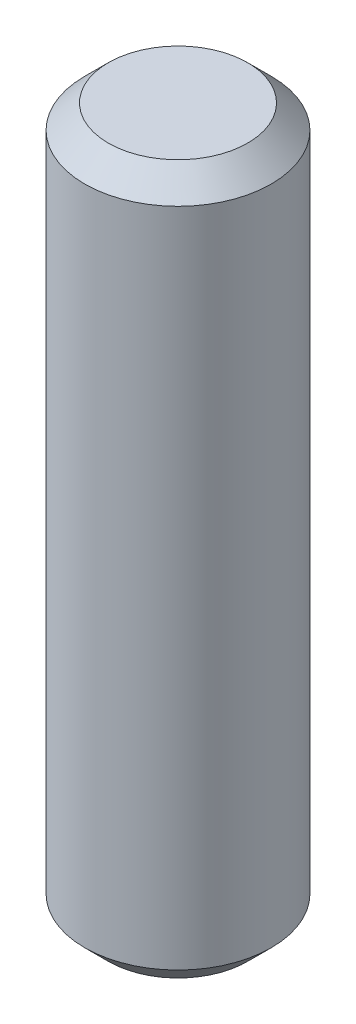
ISO-10303-21;
HEADER;
FILE_DESCRIPTION(('STEP AP214'),'2;1');
FILE_NAME('part.step','',(''),(''),'','','');
FILE_SCHEMA(('AUTOMOTIVE_DESIGN { 1 0 10303 214 1 1 1 1 }'));
ENDSEC;
DATA;
#1=APPLICATION_CONTEXT('core data for automotive mechanical design processes');
#2=APPLICATION_PROTOCOL_DEFINITION('international standard','automotive_design',2000,#1);
#3=PRODUCT_CONTEXT('',#1,'mechanical');
#4=PRODUCT('Part','Part','',(#3));
#5=PRODUCT_RELATED_PRODUCT_CATEGORY('part','',(#4));
#6=PRODUCT_DEFINITION_FORMATION('','',#4);
#7=PRODUCT_DEFINITION_CONTEXT('part definition',#1,'design');
#8=PRODUCT_DEFINITION('design','',#6,#7);
#9=PRODUCT_DEFINITION_SHAPE('','',#8);
#10=(LENGTH_UNIT() NAMED_UNIT(*) SI_UNIT(.MILLI.,.METRE.));
#11=(NAMED_UNIT(*) PLANE_ANGLE_UNIT() SI_UNIT($,.RADIAN.));
#12=(NAMED_UNIT(*) SI_UNIT($,.STERADIAN.) SOLID_ANGLE_UNIT());
#13=UNCERTAINTY_MEASURE_WITH_UNIT(LENGTH_MEASURE(1.E-05),#10,'distance_accuracy_value','');
#14=(GEOMETRIC_REPRESENTATION_CONTEXT(3) GLOBAL_UNCERTAINTY_ASSIGNED_CONTEXT((#13)) GLOBAL_UNIT_ASSIGNED_CONTEXT((#10,
#11,#12)) REPRESENTATION_CONTEXT('',''));
#15=CARTESIAN_POINT('',(0.,0.,0.));
#16=DIRECTION('',(0.,0.,1.));
#17=DIRECTION('',(1.,0.,0.));
#18=AXIS2_PLACEMENT_3D('',#15,#16,#17);
#19=CARTESIAN_POINT('',(0.,15.,0.));
#20=DIRECTION('',(0.,-1.,0.));
#21=DIRECTION('',(0.,0.,-1.));
#22=AXIS2_PLACEMENT_3D('',#19,#20,#21);
#23=CYLINDRICAL_SURFACE('',#22,3.95);
#24=CARTESIAN_POINT('',(0.,-14.,0.));
#25=DIRECTION('',(0.,1.,0.));
#26=DIRECTION('',(0.,0.,1.));
#27=AXIS2_PLACEMENT_3D('',#24,#25,#26);
#28=CIRCLE('',#27,3.95);
#29=CARTESIAN_POINT('',(0.,-14.,3.95));
#30=VERTEX_POINT('',#29);
#31=EDGE_CURVE('E47',#30,#30,#28,.T.);
#32=ORIENTED_EDGE('',*,*,#31,.T.);
#33=EDGE_LOOP('',(#32));
#34=FACE_BOUND('',#33,.T.);
#35=CARTESIAN_POINT('',(0.,14.,0.));
#36=DIRECTION('',(0.,1.,0.));
#37=DIRECTION('',(0.,0.,1.));
#38=AXIS2_PLACEMENT_3D('',#35,#36,#37);
#39=CIRCLE('',#38,3.95);
#40=CARTESIAN_POINT('',(0.,14.,3.95));
#41=VERTEX_POINT('',#40);
#42=EDGE_CURVE('E51',#41,#41,#39,.F.);
#43=ORIENTED_EDGE('',*,*,#42,.T.);
#44=EDGE_LOOP('',(#43));
#45=FACE_BOUND('',#44,.T.);
#46=ADVANCED_FACE('F35',(#34,#45),#23,.T.);
#47=CARTESIAN_POINT('',(0.,15.,0.));
#48=DIRECTION('',(0.,1.,0.));
#49=DIRECTION('',(0.,0.,1.));
#50=AXIS2_PLACEMENT_3D('',#47,#48,#49);
#51=PLANE('',#50);
#52=CARTESIAN_POINT('',(0.,15.,0.));
#53=DIRECTION('',(0.,1.,0.));
#54=DIRECTION('',(0.,0.,1.));
#55=AXIS2_PLACEMENT_3D('',#52,#53,#54);
#56=CIRCLE('',#55,2.94999999999999);
#57=CARTESIAN_POINT('',(0.,15.,2.94999999999999));
#58=VERTEX_POINT('',#57);
#59=EDGE_CURVE('E10',#58,#58,#56,.T.);
#60=ORIENTED_EDGE('',*,*,#59,.T.);
#61=EDGE_LOOP('',(#60));
#62=FACE_BOUND('',#61,.T.);
#63=ADVANCED_FACE('F67',(#62),#51,.T.);
#64=CARTESIAN_POINT('',(0.,-15.,0.));
#65=DIRECTION('',(0.,1.,0.));
#66=DIRECTION('',(0.,0.,1.));
#67=AXIS2_PLACEMENT_3D('',#64,#65,#66);
#68=PLANE('',#67);
#69=CARTESIAN_POINT('',(0.,-15.,0.));
#70=DIRECTION('',(0.,1.,0.));
#71=DIRECTION('',(0.,0.,1.));
#72=AXIS2_PLACEMENT_3D('',#69,#70,#71);
#73=CIRCLE('',#72,2.94999999999999);
#74=CARTESIAN_POINT('',(0.,-15.,2.94999999999999));
#75=VERTEX_POINT('',#74);
#76=EDGE_CURVE('E43',#75,#75,#73,.F.);
#77=ORIENTED_EDGE('',*,*,#76,.T.);
#78=EDGE_LOOP('',(#77));
#79=FACE_BOUND('',#78,.T.);
#80=ADVANCED_FACE('F64',(#79),#68,.F.);
#81=CARTESIAN_POINT('',(0.,-14.,0.));
#82=DIRECTION('',(0.,1.,0.));
#83=DIRECTION('',(0.,0.,1.));
#84=AXIS2_PLACEMENT_3D('',#81,#82,#83);
#85=CONICAL_SURFACE('',#84,3.95,0.785398163397451);
#86=ORIENTED_EDGE('',*,*,#76,.F.);
#87=EDGE_LOOP('',(#86));
#88=FACE_BOUND('',#87,.T.);
#89=ORIENTED_EDGE('',*,*,#31,.F.);
#90=EDGE_LOOP('',(#89));
#91=FACE_BOUND('',#90,.T.);
#92=ADVANCED_FACE('F60',(#88,#91),#85,.T.);
#93=CARTESIAN_POINT('',(0.,15.,0.));
#94=DIRECTION('',(0.,-1.,0.));
#95=DIRECTION('',(0.,0.,-1.));
#96=AXIS2_PLACEMENT_3D('',#93,#94,#95);
#97=CONICAL_SURFACE('',#96,2.94999999999999,0.785398163397448);
#98=ORIENTED_EDGE('',*,*,#42,.F.);
#99=EDGE_LOOP('',(#98));
#100=FACE_BOUND('',#99,.T.);
#101=ORIENTED_EDGE('',*,*,#59,.F.);
#102=EDGE_LOOP('',(#101));
#103=FACE_BOUND('',#102,.T.);
#104=ADVANCED_FACE('F38',(#100,#103),#97,.T.);
#105=CLOSED_SHELL('',(#46,#63,#80,#92,#104));
#106=MANIFOLD_SOLID_BREP('B2',#105);
#107=ADVANCED_BREP_SHAPE_REPRESENTATION('',(#18,#106),#14);
#108=SHAPE_DEFINITION_REPRESENTATION(#9,#107);
ENDSEC;
END-ISO-10303-21;
